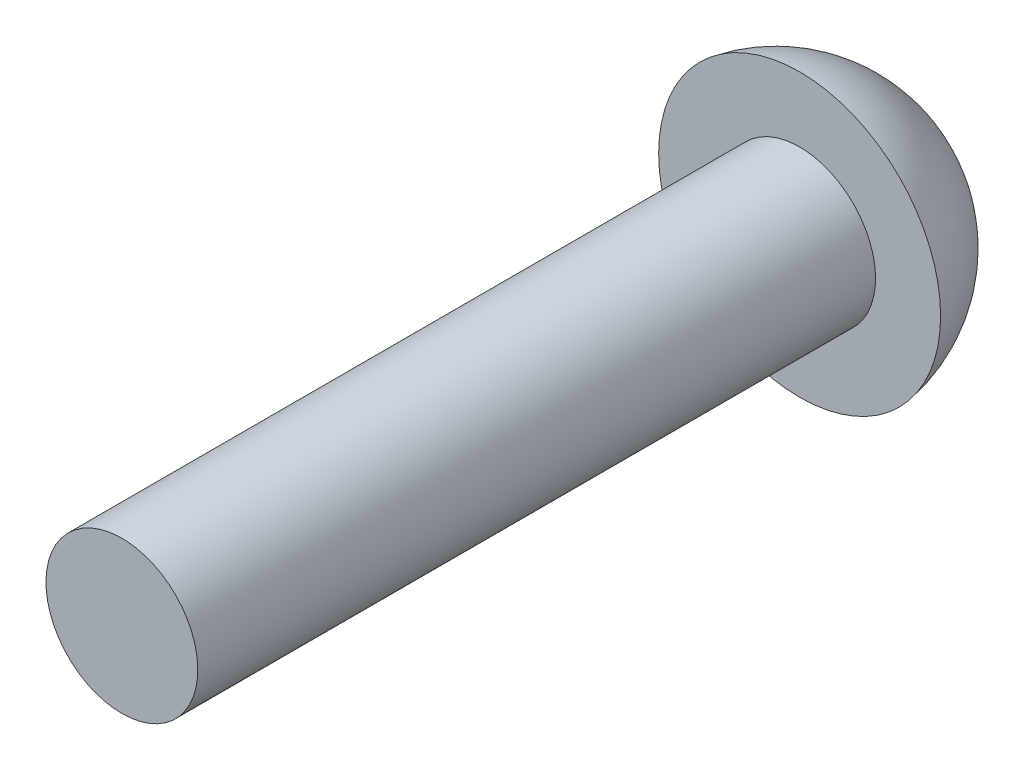
ISO-10303-21;
HEADER;
FILE_DESCRIPTION(('STEP AP214'),'2;1');
FILE_NAME('part.step','',(''),(''),'','','');
FILE_SCHEMA(('AUTOMOTIVE_DESIGN { 1 0 10303 214 1 1 1 1 }'));
ENDSEC;
DATA;
#1=APPLICATION_CONTEXT('core data for automotive mechanical design processes');
#2=APPLICATION_PROTOCOL_DEFINITION('international standard','automotive_design',2000,#1);
#3=PRODUCT_CONTEXT('',#1,'mechanical');
#4=PRODUCT('Part','Part','',(#3));
#5=PRODUCT_RELATED_PRODUCT_CATEGORY('part','',(#4));
#6=PRODUCT_DEFINITION_FORMATION('','',#4);
#7=PRODUCT_DEFINITION_CONTEXT('part definition',#1,'design');
#8=PRODUCT_DEFINITION('design','',#6,#7);
#9=PRODUCT_DEFINITION_SHAPE('','',#8);
#10=(LENGTH_UNIT() NAMED_UNIT(*) SI_UNIT(.MILLI.,.METRE.));
#11=(NAMED_UNIT(*) PLANE_ANGLE_UNIT() SI_UNIT($,.RADIAN.));
#12=(NAMED_UNIT(*) SI_UNIT($,.STERADIAN.) SOLID_ANGLE_UNIT());
#13=UNCERTAINTY_MEASURE_WITH_UNIT(LENGTH_MEASURE(1.E-05),#10,'distance_accuracy_value','');
#14=(GEOMETRIC_REPRESENTATION_CONTEXT(3) GLOBAL_UNCERTAINTY_ASSIGNED_CONTEXT((#13)) GLOBAL_UNIT_ASSIGNED_CONTEXT((#10,
#11,#12)) REPRESENTATION_CONTEXT('',''));
#15=CARTESIAN_POINT('',(0.,0.,0.));
#16=DIRECTION('',(0.,0.,1.));
#17=DIRECTION('',(1.,0.,0.));
#18=AXIS2_PLACEMENT_3D('',#15,#16,#17);
#19=CARTESIAN_POINT('',(0.,0.,-12.2566545454545));
#20=DIRECTION('',(0.,0.,1.));
#21=DIRECTION('',(0.,1.,0.));
#22=AXIS2_PLACEMENT_3D('',#19,#20,#21);
#23=SPHERICAL_SURFACE('',#22,2.67854545454545);
#24=CARTESIAN_POINT('',(0.,0.,-12.7));
#25=DIRECTION('',(0.,0.,1.));
#26=DIRECTION('',(0.,-1.,0.));
#27=AXIS2_PLACEMENT_3D('',#24,#25,#26);
#28=CIRCLE('',#27,2.6416);
#29=CARTESIAN_POINT('',(0.,-2.6416,-12.7));
#30=VERTEX_POINT('',#29);
#31=EDGE_CURVE('E10',#30,#30,#28,.T.);
#32=ORIENTED_EDGE('',*,*,#31,.F.);
#33=EDGE_LOOP('',(#32));
#34=FACE_BOUND('',#33,.T.);
#35=ADVANCED_FACE('F358',(#34),#23,.T.);
#36=CARTESIAN_POINT('',(0.,1.4224,-12.7));
#37=DIRECTION('',(0.,0.,-1.));
#38=DIRECTION('',(0.,1.,0.));
#39=AXIS2_PLACEMENT_3D('',#36,#37,#38);
#40=PLANE('',#39);
#41=CARTESIAN_POINT('',(0.,0.,-12.7));
#42=DIRECTION('',(0.,0.,1.));
#43=DIRECTION('',(0.,-1.,0.));
#44=AXIS2_PLACEMENT_3D('',#41,#42,#43);
#45=CIRCLE('',#44,1.4224);
#46=CARTESIAN_POINT('',(0.,-1.4224,-12.7));
#47=VERTEX_POINT('',#46);
#48=EDGE_CURVE('E364',#47,#47,#45,.T.);
#49=ORIENTED_EDGE('',*,*,#48,.F.);
#50=EDGE_LOOP('',(#49));
#51=FACE_BOUND('',#50,.T.);
#52=ORIENTED_EDGE('',*,*,#31,.T.);
#53=EDGE_LOOP('',(#52));
#54=FACE_BOUND('',#53,.T.);
#55=ADVANCED_FACE('F379',(#51,#54),#40,.F.);
#56=CARTESIAN_POINT('',(0.,0.,0.));
#57=DIRECTION('',(0.,0.,1.));
#58=DIRECTION('',(0.,-1.,0.));
#59=AXIS2_PLACEMENT_3D('',#56,#57,#58);
#60=CYLINDRICAL_SURFACE('',#59,1.4224);
#61=CARTESIAN_POINT('',(0.,0.,0.));
#62=DIRECTION('',(0.,0.,1.));
#63=DIRECTION('',(0.,-1.,0.));
#64=AXIS2_PLACEMENT_3D('',#61,#62,#63);
#65=CIRCLE('',#64,1.4224);
#66=CARTESIAN_POINT('',(0.,-1.4224,0.));
#67=VERTEX_POINT('',#66);
#68=EDGE_CURVE('E368',#67,#67,#65,.T.);
#69=ORIENTED_EDGE('',*,*,#68,.F.);
#70=EDGE_LOOP('',(#69));
#71=FACE_BOUND('',#70,.T.);
#72=ORIENTED_EDGE('',*,*,#48,.T.);
#73=EDGE_LOOP('',(#72));
#74=FACE_BOUND('',#73,.T.);
#75=ADVANCED_FACE('F377',(#71,#74),#60,.T.);
#76=CARTESIAN_POINT('',(0.,0.,0.));
#77=DIRECTION('',(0.,0.,-1.));
#78=DIRECTION('',(0.,1.,0.));
#79=AXIS2_PLACEMENT_3D('',#76,#77,#78);
#80=PLANE('',#79);
#81=ORIENTED_EDGE('',*,*,#68,.T.);
#82=EDGE_LOOP('',(#81));
#83=FACE_BOUND('',#82,.T.);
#84=ADVANCED_FACE('F375',(#83),#80,.F.);
#85=CLOSED_SHELL('',(#35,#55,#75,#84));
#86=MANIFOLD_SOLID_BREP('B2',#85);
#87=ADVANCED_BREP_SHAPE_REPRESENTATION('',(#18,#86),#14);
#88=SHAPE_DEFINITION_REPRESENTATION(#9,#87);
ENDSEC;
END-ISO-10303-21;
